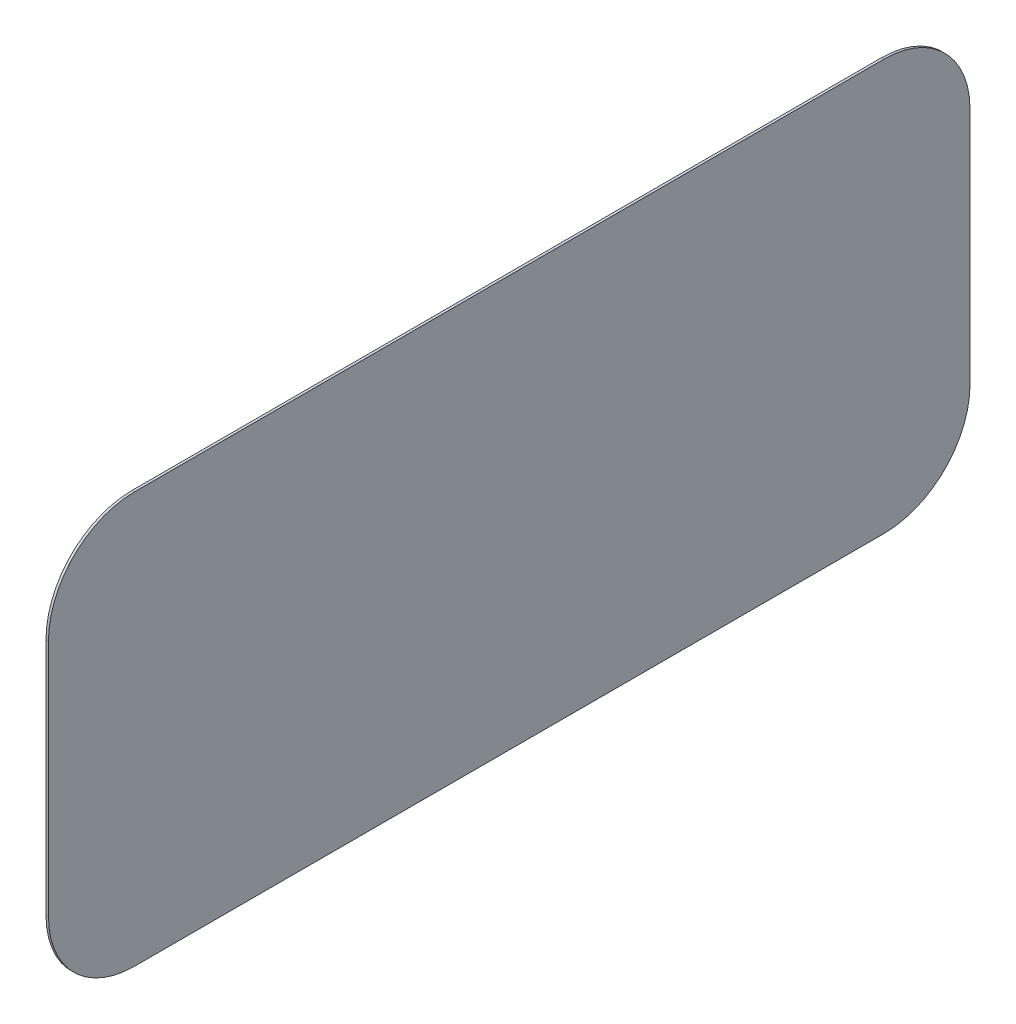
ISO-10303-21;
HEADER;
FILE_DESCRIPTION(('STEP AP214'),'2;1');
FILE_NAME('part.step','',(''),(''),'','','');
FILE_SCHEMA(('AUTOMOTIVE_DESIGN { 1 0 10303 214 1 1 1 1 }'));
ENDSEC;
DATA;
#1=APPLICATION_CONTEXT('core data for automotive mechanical design processes');
#2=APPLICATION_PROTOCOL_DEFINITION('international standard','automotive_design',2000,#1);
#3=PRODUCT_CONTEXT('',#1,'mechanical');
#4=PRODUCT('Part','Part','',(#3));
#5=PRODUCT_RELATED_PRODUCT_CATEGORY('part','',(#4));
#6=PRODUCT_DEFINITION_FORMATION('','',#4);
#7=PRODUCT_DEFINITION_CONTEXT('part definition',#1,'design');
#8=PRODUCT_DEFINITION('design','',#6,#7);
#9=PRODUCT_DEFINITION_SHAPE('','',#8);
#10=(LENGTH_UNIT() NAMED_UNIT(*) SI_UNIT(.MILLI.,.METRE.));
#11=(NAMED_UNIT(*) PLANE_ANGLE_UNIT() SI_UNIT($,.RADIAN.));
#12=(NAMED_UNIT(*) SI_UNIT($,.STERADIAN.) SOLID_ANGLE_UNIT());
#13=UNCERTAINTY_MEASURE_WITH_UNIT(LENGTH_MEASURE(1.E-05),#10,'distance_accuracy_value','');
#14=(GEOMETRIC_REPRESENTATION_CONTEXT(3) GLOBAL_UNCERTAINTY_ASSIGNED_CONTEXT((#13)) GLOBAL_UNIT_ASSIGNED_CONTEXT((#10,
#11,#12)) REPRESENTATION_CONTEXT('',''));
#15=CARTESIAN_POINT('',(0.,0.,0.));
#16=DIRECTION('',(0.,0.,1.));
#17=DIRECTION('',(1.,0.,0.));
#18=AXIS2_PLACEMENT_3D('',#15,#16,#17);
#19=CARTESIAN_POINT('',(-10.,350.,0.));
#20=DIRECTION('',(1.,0.,0.));
#21=DIRECTION('',(0.,0.,-1.));
#22=AXIS2_PLACEMENT_3D('',#19,#20,#21);
#23=CYLINDRICAL_SURFACE('',#22,350.);
#24=CARTESIAN_POINT('',(0.,350.,0.));
#25=DIRECTION('',(1.,0.,0.));
#26=DIRECTION('',(0.,0.,-1.));
#27=AXIS2_PLACEMENT_3D('',#24,#25,#26);
#28=CIRCLE('',#27,350.);
#29=CARTESIAN_POINT('',(0.,350.,350.));
#30=VERTEX_POINT('',#29);
#31=CARTESIAN_POINT('',(0.,0.,0.));
#32=VERTEX_POINT('',#31);
#33=EDGE_CURVE('E142',#30,#32,#28,.T.);
#34=ORIENTED_EDGE('',*,*,#33,.F.);
#35=DIRECTION('',(1.,0.,0.));
#36=VECTOR('',#35,1.);
#37=CARTESIAN_POINT('',(-10.,350.,350.));
#38=LINE('',#37,#36);
#39=CARTESIAN_POINT('',(-10.,350.,350.));
#40=VERTEX_POINT('',#39);
#41=EDGE_CURVE('E11',#40,#30,#38,.T.);
#42=ORIENTED_EDGE('',*,*,#41,.F.);
#43=CARTESIAN_POINT('',(-10.,350.,0.));
#44=DIRECTION('',(1.,0.,0.));
#45=DIRECTION('',(0.,0.,-1.));
#46=AXIS2_PLACEMENT_3D('',#43,#44,#45);
#47=CIRCLE('',#46,350.);
#48=CARTESIAN_POINT('',(-10.,0.,0.));
#49=VERTEX_POINT('',#48);
#50=EDGE_CURVE('E170',#40,#49,#47,.T.);
#51=ORIENTED_EDGE('',*,*,#50,.T.);
#52=DIRECTION('',(1.,0.,0.));
#53=VECTOR('',#52,1.);
#54=CARTESIAN_POINT('',(-10.,0.,0.));
#55=LINE('',#54,#53);
#56=EDGE_CURVE('E42',#49,#32,#55,.T.);
#57=ORIENTED_EDGE('',*,*,#56,.T.);
#58=EDGE_LOOP('',(#34,#42,#51,#57));
#59=FACE_BOUND('',#58,.T.);
#60=ADVANCED_FACE('F39',(#59),#23,.T.);
#61=CARTESIAN_POINT('',(-10.,1322.,350.));
#62=DIRECTION('',(0.,0.,1.));
#63=DIRECTION('',(0.,-1.,0.));
#64=AXIS2_PLACEMENT_3D('',#61,#62,#63);
#65=PLANE('',#64);
#66=DIRECTION('',(0.,-1.,0.));
#67=VECTOR('',#66,1.);
#68=CARTESIAN_POINT('',(0.,1322.,350.));
#69=LINE('',#68,#67);
#70=CARTESIAN_POINT('',(0.,1322.,350.));
#71=VERTEX_POINT('',#70);
#72=EDGE_CURVE('E167',#71,#30,#69,.T.);
#73=ORIENTED_EDGE('',*,*,#72,.F.);
#74=DIRECTION('',(1.,0.,0.));
#75=VECTOR('',#74,1.);
#76=CARTESIAN_POINT('',(-10.,1322.,350.));
#77=LINE('',#76,#75);
#78=CARTESIAN_POINT('',(-10.,1322.,350.));
#79=VERTEX_POINT('',#78);
#80=EDGE_CURVE('E49',#79,#71,#77,.T.);
#81=ORIENTED_EDGE('',*,*,#80,.F.);
#82=DIRECTION('',(0.,-1.,0.));
#83=VECTOR('',#82,1.);
#84=CARTESIAN_POINT('',(-10.,1322.,350.));
#85=LINE('',#84,#83);
#86=EDGE_CURVE('E128',#79,#40,#85,.T.);
#87=ORIENTED_EDGE('',*,*,#86,.T.);
#88=ORIENTED_EDGE('',*,*,#41,.T.);
#89=EDGE_LOOP('',(#73,#81,#87,#88));
#90=FACE_BOUND('',#89,.T.);
#91=ADVANCED_FACE('F188',(#90),#65,.T.);
#92=CARTESIAN_POINT('',(-10.,1322.,1.66533453693773E-13));
#93=DIRECTION('',(1.,0.,0.));
#94=DIRECTION('',(0.,0.,-1.));
#95=AXIS2_PLACEMENT_3D('',#92,#93,#94);
#96=CYLINDRICAL_SURFACE('',#95,350.);
#97=CARTESIAN_POINT('',(0.,1322.,1.66533453693773E-13));
#98=DIRECTION('',(1.,0.,0.));
#99=DIRECTION('',(0.,0.,-1.));
#100=AXIS2_PLACEMENT_3D('',#97,#98,#99);
#101=CIRCLE('',#100,350.);
#102=CARTESIAN_POINT('',(0.,1672.,2.22044604925031E-13));
#103=VERTEX_POINT('',#102);
#104=EDGE_CURVE('E114',#103,#71,#101,.T.);
#105=ORIENTED_EDGE('',*,*,#104,.F.);
#106=DIRECTION('',(1.,0.,0.));
#107=VECTOR('',#106,1.);
#108=CARTESIAN_POINT('',(-10.,1672.,2.22044604925031E-13));
#109=LINE('',#108,#107);
#110=CARTESIAN_POINT('',(-10.,1672.,2.22044604925031E-13));
#111=VERTEX_POINT('',#110);
#112=EDGE_CURVE('E109',#111,#103,#109,.T.);
#113=ORIENTED_EDGE('',*,*,#112,.F.);
#114=CARTESIAN_POINT('',(-10.,1322.,1.66533453693773E-13));
#115=DIRECTION('',(1.,0.,0.));
#116=DIRECTION('',(0.,0.,-1.));
#117=AXIS2_PLACEMENT_3D('',#114,#115,#116);
#118=CIRCLE('',#117,350.);
#119=EDGE_CURVE('E112',#111,#79,#118,.T.);
#120=ORIENTED_EDGE('',*,*,#119,.T.);
#121=ORIENTED_EDGE('',*,*,#80,.T.);
#122=EDGE_LOOP('',(#105,#113,#120,#121));
#123=FACE_BOUND('',#122,.T.);
#124=ADVANCED_FACE('F111',(#123),#96,.T.);
#125=CARTESIAN_POINT('',(-10.,1672.,-3050.));
#126=DIRECTION('',(0.,1.,0.));
#127=DIRECTION('',(0.,0.,1.));
#128=AXIS2_PLACEMENT_3D('',#125,#126,#127);
#129=PLANE('',#128);
#130=DIRECTION('',(0.,0.,1.));
#131=VECTOR('',#130,1.);
#132=CARTESIAN_POINT('',(0.,1672.,-3050.));
#133=LINE('',#132,#131);
#134=CARTESIAN_POINT('',(0.,1672.,-3050.));
#135=VERTEX_POINT('',#134);
#136=EDGE_CURVE('E162',#135,#103,#133,.T.);
#137=ORIENTED_EDGE('',*,*,#136,.F.);
#138=DIRECTION('',(1.,0.,0.));
#139=VECTOR('',#138,1.);
#140=CARTESIAN_POINT('',(-10.,1672.,-3050.));
#141=LINE('',#140,#139);
#142=CARTESIAN_POINT('',(-10.,1672.,-3050.));
#143=VERTEX_POINT('',#142);
#144=EDGE_CURVE('E120',#143,#135,#141,.T.);
#145=ORIENTED_EDGE('',*,*,#144,.F.);
#146=DIRECTION('',(0.,0.,1.));
#147=VECTOR('',#146,1.);
#148=CARTESIAN_POINT('',(-10.,1672.,-3050.));
#149=LINE('',#148,#147);
#150=EDGE_CURVE('E126',#143,#111,#149,.T.);
#151=ORIENTED_EDGE('',*,*,#150,.T.);
#152=ORIENTED_EDGE('',*,*,#112,.T.);
#153=EDGE_LOOP('',(#137,#145,#151,#152));
#154=FACE_BOUND('',#153,.T.);
#155=ADVANCED_FACE('F131',(#154),#129,.T.);
#156=CARTESIAN_POINT('',(-10.,1322.,-3050.));
#157=DIRECTION('',(1.,0.,0.));
#158=DIRECTION('',(0.,0.,-1.));
#159=AXIS2_PLACEMENT_3D('',#156,#157,#158);
#160=CYLINDRICAL_SURFACE('',#159,350.);
#161=CARTESIAN_POINT('',(0.,1322.,-3050.));
#162=DIRECTION('',(1.,0.,0.));
#163=DIRECTION('',(0.,0.,-1.));
#164=AXIS2_PLACEMENT_3D('',#161,#162,#163);
#165=CIRCLE('',#164,350.);
#166=CARTESIAN_POINT('',(0.,1322.,-3400.));
#167=VERTEX_POINT('',#166);
#168=EDGE_CURVE('E158',#167,#135,#165,.T.);
#169=ORIENTED_EDGE('',*,*,#168,.F.);
#170=DIRECTION('',(1.,0.,0.));
#171=VECTOR('',#170,1.);
#172=CARTESIAN_POINT('',(-10.,1322.,-3400.));
#173=LINE('',#172,#171);
#174=CARTESIAN_POINT('',(-10.,1322.,-3400.));
#175=VERTEX_POINT('',#174);
#176=EDGE_CURVE('E176',#175,#167,#173,.T.);
#177=ORIENTED_EDGE('',*,*,#176,.F.);
#178=CARTESIAN_POINT('',(-10.,1322.,-3050.));
#179=DIRECTION('',(1.,0.,0.));
#180=DIRECTION('',(0.,0.,-1.));
#181=AXIS2_PLACEMENT_3D('',#178,#179,#180);
#182=CIRCLE('',#181,350.);
#183=EDGE_CURVE('E133',#175,#143,#182,.T.);
#184=ORIENTED_EDGE('',*,*,#183,.T.);
#185=ORIENTED_EDGE('',*,*,#144,.T.);
#186=EDGE_LOOP('',(#169,#177,#184,#185));
#187=FACE_BOUND('',#186,.T.);
#188=ADVANCED_FACE('F201',(#187),#160,.T.);
#189=CARTESIAN_POINT('',(-10.,350.,-3400.));
#190=DIRECTION('',(0.,0.,-1.));
#191=DIRECTION('',(0.,1.,0.));
#192=AXIS2_PLACEMENT_3D('',#189,#190,#191);
#193=PLANE('',#192);
#194=DIRECTION('',(0.,1.,0.));
#195=VECTOR('',#194,1.);
#196=CARTESIAN_POINT('',(0.,350.,-3400.));
#197=LINE('',#196,#195);
#198=CARTESIAN_POINT('',(0.,350.,-3400.));
#199=VERTEX_POINT('',#198);
#200=EDGE_CURVE('E154',#199,#167,#197,.T.);
#201=ORIENTED_EDGE('',*,*,#200,.F.);
#202=DIRECTION('',(1.,0.,0.));
#203=VECTOR('',#202,1.);
#204=CARTESIAN_POINT('',(-10.,350.,-3400.));
#205=LINE('',#204,#203);
#206=CARTESIAN_POINT('',(-10.,350.,-3400.));
#207=VERTEX_POINT('',#206);
#208=EDGE_CURVE('E179',#207,#199,#205,.T.);
#209=ORIENTED_EDGE('',*,*,#208,.F.);
#210=DIRECTION('',(0.,1.,0.));
#211=VECTOR('',#210,1.);
#212=CARTESIAN_POINT('',(-10.,350.,-3400.));
#213=LINE('',#212,#211);
#214=EDGE_CURVE('E136',#207,#175,#213,.T.);
#215=ORIENTED_EDGE('',*,*,#214,.T.);
#216=ORIENTED_EDGE('',*,*,#176,.T.);
#217=EDGE_LOOP('',(#201,#209,#215,#216));
#218=FACE_BOUND('',#217,.T.);
#219=ADVANCED_FACE('F204',(#218),#193,.T.);
#220=CARTESIAN_POINT('',(-10.,350.,-3050.));
#221=DIRECTION('',(1.,0.,0.));
#222=DIRECTION('',(0.,0.,-1.));
#223=AXIS2_PLACEMENT_3D('',#220,#221,#222);
#224=CYLINDRICAL_SURFACE('',#223,350.);
#225=CARTESIAN_POINT('',(0.,350.,-3050.));
#226=DIRECTION('',(1.,0.,0.));
#227=DIRECTION('',(0.,0.,-1.));
#228=AXIS2_PLACEMENT_3D('',#225,#226,#227);
#229=CIRCLE('',#228,350.);
#230=CARTESIAN_POINT('',(0.,0.,-3050.));
#231=VERTEX_POINT('',#230);
#232=EDGE_CURVE('E150',#231,#199,#229,.T.);
#233=ORIENTED_EDGE('',*,*,#232,.F.);
#234=DIRECTION('',(1.,0.,0.));
#235=VECTOR('',#234,1.);
#236=CARTESIAN_POINT('',(-10.,0.,-3050.));
#237=LINE('',#236,#235);
#238=CARTESIAN_POINT('',(-10.,0.,-3050.));
#239=VERTEX_POINT('',#238);
#240=EDGE_CURVE('E181',#239,#231,#237,.T.);
#241=ORIENTED_EDGE('',*,*,#240,.F.);
#242=CARTESIAN_POINT('',(-10.,350.,-3050.));
#243=DIRECTION('',(1.,0.,0.));
#244=DIRECTION('',(0.,0.,-1.));
#245=AXIS2_PLACEMENT_3D('',#242,#243,#244);
#246=CIRCLE('',#245,350.);
#247=EDGE_CURVE('E279',#239,#207,#246,.T.);
#248=ORIENTED_EDGE('',*,*,#247,.T.);
#249=ORIENTED_EDGE('',*,*,#208,.T.);
#250=EDGE_LOOP('',(#233,#241,#248,#249));
#251=FACE_BOUND('',#250,.T.);
#252=ADVANCED_FACE('F208',(#251),#224,.T.);
#253=CARTESIAN_POINT('',(-10.,0.,0.));
#254=DIRECTION('',(0.,-1.,0.));
#255=DIRECTION('',(0.,0.,-1.));
#256=AXIS2_PLACEMENT_3D('',#253,#254,#255);
#257=PLANE('',#256);
#258=DIRECTION('',(0.,0.,-1.));
#259=VECTOR('',#258,1.);
#260=CARTESIAN_POINT('',(0.,0.,0.));
#261=LINE('',#260,#259);
#262=EDGE_CURVE('E146',#32,#231,#261,.T.);
#263=ORIENTED_EDGE('',*,*,#262,.F.);
#264=ORIENTED_EDGE('',*,*,#56,.F.);
#265=DIRECTION('',(0.,0.,-1.));
#266=VECTOR('',#265,1.);
#267=CARTESIAN_POINT('',(-10.,0.,0.));
#268=LINE('',#267,#266);
#269=EDGE_CURVE('E282',#49,#239,#268,.T.);
#270=ORIENTED_EDGE('',*,*,#269,.T.);
#271=ORIENTED_EDGE('',*,*,#240,.T.);
#272=EDGE_LOOP('',(#263,#264,#270,#271));
#273=FACE_BOUND('',#272,.T.);
#274=ADVANCED_FACE('F185',(#273),#257,.T.);
#275=CARTESIAN_POINT('',(-10.,350.,0.));
#276=DIRECTION('',(1.,0.,0.));
#277=DIRECTION('',(0.,0.,-1.));
#278=AXIS2_PLACEMENT_3D('',#275,#276,#277);
#279=PLANE('',#278);
#280=ORIENTED_EDGE('',*,*,#50,.F.);
#281=ORIENTED_EDGE('',*,*,#86,.F.);
#282=ORIENTED_EDGE('',*,*,#119,.F.);
#283=ORIENTED_EDGE('',*,*,#150,.F.);
#284=ORIENTED_EDGE('',*,*,#183,.F.);
#285=ORIENTED_EDGE('',*,*,#214,.F.);
#286=ORIENTED_EDGE('',*,*,#247,.F.);
#287=ORIENTED_EDGE('',*,*,#269,.F.);
#288=EDGE_LOOP('',(#280,#281,#282,#283,#284,#285,#286,#287));
#289=FACE_BOUND('',#288,.T.);
#290=ADVANCED_FACE('F124',(#289),#279,.F.);
#291=CARTESIAN_POINT('',(0.,350.,0.));
#292=DIRECTION('',(1.,0.,0.));
#293=DIRECTION('',(0.,0.,-1.));
#294=AXIS2_PLACEMENT_3D('',#291,#292,#293);
#295=PLANE('',#294);
#296=ORIENTED_EDGE('',*,*,#33,.T.);
#297=ORIENTED_EDGE('',*,*,#262,.T.);
#298=ORIENTED_EDGE('',*,*,#232,.T.);
#299=ORIENTED_EDGE('',*,*,#200,.T.);
#300=ORIENTED_EDGE('',*,*,#168,.T.);
#301=ORIENTED_EDGE('',*,*,#136,.T.);
#302=ORIENTED_EDGE('',*,*,#104,.T.);
#303=ORIENTED_EDGE('',*,*,#72,.T.);
#304=EDGE_LOOP('',(#296,#297,#298,#299,#300,#301,#302,#303));
#305=FACE_BOUND('',#304,.T.);
#306=ADVANCED_FACE('F187',(#305),#295,.T.);
#307=CLOSED_SHELL('',(#60,#91,#124,#155,#188,#219,#252,#274,#290,#306));
#308=MANIFOLD_SOLID_BREP('B2',#307);
#309=ADVANCED_BREP_SHAPE_REPRESENTATION('',(#18,#308),#14);
#310=SHAPE_DEFINITION_REPRESENTATION(#9,#309);
ENDSEC;
END-ISO-10303-21;
